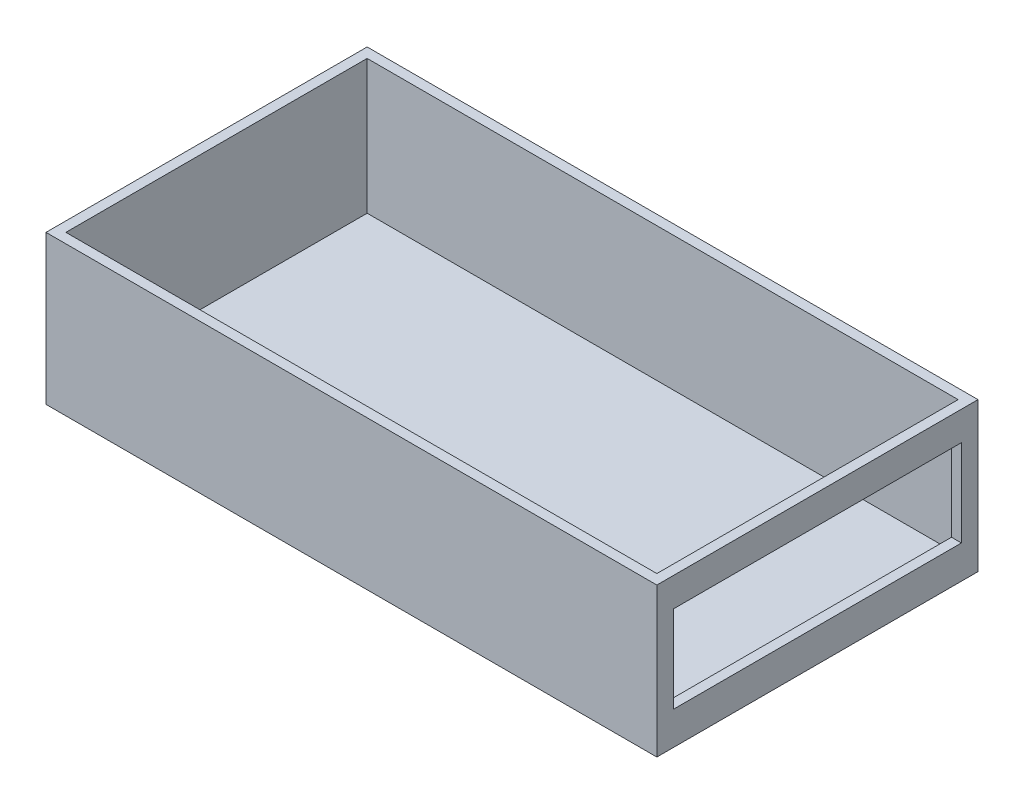
ISO-10303-21;
HEADER;
FILE_DESCRIPTION(('STEP AP214'),'2;1');
FILE_NAME('part.step','',(''),(''),'','','');
FILE_SCHEMA(('AUTOMOTIVE_DESIGN { 1 0 10303 214 1 1 1 1 }'));
ENDSEC;
DATA;
#1=APPLICATION_CONTEXT('core data for automotive mechanical design processes');
#2=APPLICATION_PROTOCOL_DEFINITION('international standard','automotive_design',2000,#1);
#3=PRODUCT_CONTEXT('',#1,'mechanical');
#4=PRODUCT('Part','Part','',(#3));
#5=PRODUCT_RELATED_PRODUCT_CATEGORY('part','',(#4));
#6=PRODUCT_DEFINITION_FORMATION('','',#4);
#7=PRODUCT_DEFINITION_CONTEXT('part definition',#1,'design');
#8=PRODUCT_DEFINITION('design','',#6,#7);
#9=PRODUCT_DEFINITION_SHAPE('','',#8);
#10=(LENGTH_UNIT() NAMED_UNIT(*) SI_UNIT(.MILLI.,.METRE.));
#11=(NAMED_UNIT(*) PLANE_ANGLE_UNIT() SI_UNIT($,.RADIAN.));
#12=(NAMED_UNIT(*) SI_UNIT($,.STERADIAN.) SOLID_ANGLE_UNIT());
#13=UNCERTAINTY_MEASURE_WITH_UNIT(LENGTH_MEASURE(1.E-05),#10,'distance_accuracy_value','');
#14=(GEOMETRIC_REPRESENTATION_CONTEXT(3) GLOBAL_UNCERTAINTY_ASSIGNED_CONTEXT((#13)) GLOBAL_UNIT_ASSIGNED_CONTEXT((#10,
#11,#12)) REPRESENTATION_CONTEXT('',''));
#15=CARTESIAN_POINT('',(0.,0.,0.));
#16=DIRECTION('',(0.,0.,1.));
#17=DIRECTION('',(1.,0.,0.));
#18=AXIS2_PLACEMENT_3D('',#15,#16,#17);
#19=CARTESIAN_POINT('',(-36.9,1.8,0.));
#20=DIRECTION('',(-1.,0.,0.));
#21=DIRECTION('',(0.,0.,1.));
#22=AXIS2_PLACEMENT_3D('',#19,#20,#21);
#23=PLANE('',#22);
#24=DIRECTION('',(0.,0.,-1.));
#25=VECTOR('',#24,1.);
#26=CARTESIAN_POINT('',(-36.9,0.,0.));
#27=LINE('',#26,#25);
#28=CARTESIAN_POINT('',(-36.9,0.,19.4));
#29=VERTEX_POINT('',#28);
#30=CARTESIAN_POINT('',(-36.9,0.,-19.4));
#31=VERTEX_POINT('',#30);
#32=EDGE_CURVE('E202',#29,#31,#27,.T.);
#33=ORIENTED_EDGE('',*,*,#32,.F.);
#34=DIRECTION('',(0.,-1.,0.));
#35=VECTOR('',#34,1.);
#36=CARTESIAN_POINT('',(-36.9,1.8,19.4));
#37=LINE('',#36,#35);
#38=CARTESIAN_POINT('',(-36.9,18.,19.4));
#39=VERTEX_POINT('',#38);
#40=EDGE_CURVE('E11',#39,#29,#37,.T.);
#41=ORIENTED_EDGE('',*,*,#40,.F.);
#42=DIRECTION('',(0.,0.,1.));
#43=VECTOR('',#42,1.);
#44=CARTESIAN_POINT('',(-36.9,18.,19.4));
#45=LINE('',#44,#43);
#46=CARTESIAN_POINT('',(-36.9,18.,-19.4));
#47=VERTEX_POINT('',#46);
#48=EDGE_CURVE('E178',#47,#39,#45,.T.);
#49=ORIENTED_EDGE('',*,*,#48,.F.);
#50=DIRECTION('',(0.,-1.,0.));
#51=VECTOR('',#50,1.);
#52=CARTESIAN_POINT('',(-36.9,1.8,-19.4));
#53=LINE('',#52,#51);
#54=EDGE_CURVE('E213',#47,#31,#53,.T.);
#55=ORIENTED_EDGE('',*,*,#54,.T.);
#56=EDGE_LOOP('',(#33,#41,#49,#55));
#57=FACE_BOUND('',#56,.T.);
#58=ADVANCED_FACE('F33',(#57),#23,.T.);
#59=CARTESIAN_POINT('',(0.,1.8,19.4));
#60=DIRECTION('',(0.,0.,1.));
#61=DIRECTION('',(1.,0.,0.));
#62=AXIS2_PLACEMENT_3D('',#59,#60,#61);
#63=PLANE('',#62);
#64=DIRECTION('',(-1.,0.,0.));
#65=VECTOR('',#64,1.);
#66=CARTESIAN_POINT('',(0.,0.,19.4));
#67=LINE('',#66,#65);
#68=CARTESIAN_POINT('',(36.9,0.,19.4));
#69=VERTEX_POINT('',#68);
#70=EDGE_CURVE('E205',#69,#29,#67,.T.);
#71=ORIENTED_EDGE('',*,*,#70,.F.);
#72=DIRECTION('',(0.,-1.,0.));
#73=VECTOR('',#72,1.);
#74=CARTESIAN_POINT('',(36.9,1.8,19.4));
#75=LINE('',#74,#73);
#76=CARTESIAN_POINT('',(36.9,18.,19.4));
#77=VERTEX_POINT('',#76);
#78=EDGE_CURVE('E40',#77,#69,#75,.T.);
#79=ORIENTED_EDGE('',*,*,#78,.F.);
#80=DIRECTION('',(1.,0.,0.));
#81=VECTOR('',#80,1.);
#82=CARTESIAN_POINT('',(36.9,18.,19.4));
#83=LINE('',#82,#81);
#84=EDGE_CURVE('E181',#39,#77,#83,.T.);
#85=ORIENTED_EDGE('',*,*,#84,.F.);
#86=ORIENTED_EDGE('',*,*,#40,.T.);
#87=EDGE_LOOP('',(#71,#79,#85,#86));
#88=FACE_BOUND('',#87,.T.);
#89=ADVANCED_FACE('F227',(#88),#63,.T.);
#90=CARTESIAN_POINT('',(36.9,1.8,0.));
#91=DIRECTION('',(-1.,0.,0.));
#92=DIRECTION('',(0.,0.,1.));
#93=AXIS2_PLACEMENT_3D('',#90,#91,#92);
#94=PLANE('',#93);
#95=DIRECTION('',(0.,1.,0.));
#96=VECTOR('',#95,1.);
#97=CARTESIAN_POINT('',(36.9,4.,-17.4));
#98=LINE('',#97,#96);
#99=CARTESIAN_POINT('',(36.9,4.,-17.4));
#100=VERTEX_POINT('',#99);
#101=CARTESIAN_POINT('',(36.9,14.5,-17.4));
#102=VERTEX_POINT('',#101);
#103=EDGE_CURVE('E144',#100,#102,#98,.T.);
#104=ORIENTED_EDGE('',*,*,#103,.F.);
#105=DIRECTION('',(0.,0.,-1.));
#106=VECTOR('',#105,1.);
#107=CARTESIAN_POINT('',(36.9,4.,-17.4));
#108=LINE('',#107,#106);
#109=CARTESIAN_POINT('',(36.9,4.,17.4));
#110=VERTEX_POINT('',#109);
#111=EDGE_CURVE('E137',#110,#100,#108,.T.);
#112=ORIENTED_EDGE('',*,*,#111,.F.);
#113=DIRECTION('',(0.,-1.,0.));
#114=VECTOR('',#113,1.);
#115=CARTESIAN_POINT('',(36.9,4.,17.4));
#116=LINE('',#115,#114);
#117=CARTESIAN_POINT('',(36.9,14.5,17.4));
#118=VERTEX_POINT('',#117);
#119=EDGE_CURVE('E148',#118,#110,#116,.T.);
#120=ORIENTED_EDGE('',*,*,#119,.F.);
#121=DIRECTION('',(0.,0.,1.));
#122=VECTOR('',#121,1.);
#123=CARTESIAN_POINT('',(36.9,14.5,-17.4));
#124=LINE('',#123,#122);
#125=EDGE_CURVE('E47',#102,#118,#124,.T.);
#126=ORIENTED_EDGE('',*,*,#125,.F.);
#127=EDGE_LOOP('',(#104,#112,#120,#126));
#128=FACE_BOUND('',#127,.T.);
#129=DIRECTION('',(0.,0.,-1.));
#130=VECTOR('',#129,1.);
#131=CARTESIAN_POINT('',(36.9,0.,0.));
#132=LINE('',#131,#130);
#133=CARTESIAN_POINT('',(36.9,0.,-19.4));
#134=VERTEX_POINT('',#133);
#135=EDGE_CURVE('E208',#69,#134,#132,.T.);
#136=ORIENTED_EDGE('',*,*,#135,.T.);
#137=DIRECTION('',(0.,-1.,0.));
#138=VECTOR('',#137,1.);
#139=CARTESIAN_POINT('',(36.9,1.8,-19.4));
#140=LINE('',#139,#138);
#141=CARTESIAN_POINT('',(36.9,18.,-19.4));
#142=VERTEX_POINT('',#141);
#143=EDGE_CURVE('E215',#142,#134,#140,.T.);
#144=ORIENTED_EDGE('',*,*,#143,.F.);
#145=DIRECTION('',(0.,0.,-1.));
#146=VECTOR('',#145,1.);
#147=CARTESIAN_POINT('',(36.9,18.,19.4));
#148=LINE('',#147,#146);
#149=EDGE_CURVE('E184',#77,#142,#148,.T.);
#150=ORIENTED_EDGE('',*,*,#149,.F.);
#151=ORIENTED_EDGE('',*,*,#78,.T.);
#152=EDGE_LOOP('',(#136,#144,#150,#151));
#153=FACE_BOUND('',#152,.T.);
#154=ADVANCED_FACE('F220',(#128,#153),#94,.F.);
#155=CARTESIAN_POINT('',(0.,1.8,-19.4));
#156=DIRECTION('',(0.,0.,1.));
#157=DIRECTION('',(1.,0.,0.));
#158=AXIS2_PLACEMENT_3D('',#155,#156,#157);
#159=PLANE('',#158);
#160=DIRECTION('',(-1.,0.,0.));
#161=VECTOR('',#160,1.);
#162=CARTESIAN_POINT('',(0.,0.,-19.4));
#163=LINE('',#162,#161);
#164=EDGE_CURVE('E210',#134,#31,#163,.T.);
#165=ORIENTED_EDGE('',*,*,#164,.T.);
#166=ORIENTED_EDGE('',*,*,#54,.F.);
#167=DIRECTION('',(-1.,0.,0.));
#168=VECTOR('',#167,1.);
#169=CARTESIAN_POINT('',(36.9,18.,-19.4));
#170=LINE('',#169,#168);
#171=EDGE_CURVE('E187',#142,#47,#170,.T.);
#172=ORIENTED_EDGE('',*,*,#171,.F.);
#173=ORIENTED_EDGE('',*,*,#143,.T.);
#174=EDGE_LOOP('',(#165,#166,#172,#173));
#175=FACE_BOUND('',#174,.T.);
#176=ADVANCED_FACE('F233',(#175),#159,.F.);
#177=CARTESIAN_POINT('',(0.,0.,0.));
#178=DIRECTION('',(0.,1.,0.));
#179=DIRECTION('',(0.,0.,1.));
#180=AXIS2_PLACEMENT_3D('',#177,#178,#179);
#181=PLANE('',#180);
#182=ORIENTED_EDGE('',*,*,#32,.T.);
#183=ORIENTED_EDGE('',*,*,#164,.F.);
#184=ORIENTED_EDGE('',*,*,#135,.F.);
#185=ORIENTED_EDGE('',*,*,#70,.T.);
#186=EDGE_LOOP('',(#182,#183,#184,#185));
#187=FACE_BOUND('',#186,.T.);
#188=ADVANCED_FACE('F226',(#187),#181,.F.);
#189=CARTESIAN_POINT('',(0.,18.,0.));
#190=DIRECTION('',(0.,1.,0.));
#191=DIRECTION('',(0.,0.,1.));
#192=AXIS2_PLACEMENT_3D('',#189,#190,#191);
#193=PLANE('',#192);
#194=ORIENTED_EDGE('',*,*,#48,.T.);
#195=ORIENTED_EDGE('',*,*,#84,.T.);
#196=ORIENTED_EDGE('',*,*,#149,.T.);
#197=ORIENTED_EDGE('',*,*,#171,.T.);
#198=EDGE_LOOP('',(#194,#195,#196,#197));
#199=FACE_BOUND('',#198,.T.);
#200=DIRECTION('',(1.,0.,0.));
#201=VECTOR('',#200,1.);
#202=CARTESIAN_POINT('',(35.7,18.,18.2));
#203=LINE('',#202,#201);
#204=CARTESIAN_POINT('',(-35.7,18.,18.2));
#205=VERTEX_POINT('',#204);
#206=CARTESIAN_POINT('',(35.7,18.,18.2));
#207=VERTEX_POINT('',#206);
#208=EDGE_CURVE('E159',#205,#207,#203,.T.);
#209=ORIENTED_EDGE('',*,*,#208,.F.);
#210=DIRECTION('',(0.,0.,1.));
#211=VECTOR('',#210,1.);
#212=CARTESIAN_POINT('',(-35.7,18.,18.2));
#213=LINE('',#212,#211);
#214=CARTESIAN_POINT('',(-35.7,18.,-18.2));
#215=VERTEX_POINT('',#214);
#216=EDGE_CURVE('E157',#215,#205,#213,.T.);
#217=ORIENTED_EDGE('',*,*,#216,.F.);
#218=DIRECTION('',(-1.,0.,0.));
#219=VECTOR('',#218,1.);
#220=CARTESIAN_POINT('',(35.7,18.,-18.2));
#221=LINE('',#220,#219);
#222=CARTESIAN_POINT('',(35.7,18.,-18.2));
#223=VERTEX_POINT('',#222);
#224=EDGE_CURVE('E164',#223,#215,#221,.T.);
#225=ORIENTED_EDGE('',*,*,#224,.F.);
#226=DIRECTION('',(0.,0.,-1.));
#227=VECTOR('',#226,1.);
#228=CARTESIAN_POINT('',(35.7,18.,18.2));
#229=LINE('',#228,#227);
#230=EDGE_CURVE('E161',#207,#223,#229,.T.);
#231=ORIENTED_EDGE('',*,*,#230,.F.);
#232=EDGE_LOOP('',(#209,#217,#225,#231));
#233=FACE_BOUND('',#232,.T.);
#234=ADVANCED_FACE('F235',(#199,#233),#193,.T.);
#235=CARTESIAN_POINT('',(-35.7,18.,18.2));
#236=DIRECTION('',(1.,0.,0.));
#237=DIRECTION('',(0.,0.,-1.));
#238=AXIS2_PLACEMENT_3D('',#235,#236,#237);
#239=PLANE('',#238);
#240=DIRECTION('',(0.,-1.,0.));
#241=VECTOR('',#240,1.);
#242=CARTESIAN_POINT('',(-35.7,18.,18.2));
#243=LINE('',#242,#241);
#244=CARTESIAN_POINT('',(-35.7,1.8,18.2));
#245=VERTEX_POINT('',#244);
#246=EDGE_CURVE('E175',#205,#245,#243,.T.);
#247=ORIENTED_EDGE('',*,*,#246,.T.);
#248=DIRECTION('',(0.,0.,-1.));
#249=VECTOR('',#248,1.);
#250=CARTESIAN_POINT('',(-35.7,1.8,0.));
#251=LINE('',#250,#249);
#252=CARTESIAN_POINT('',(-35.7,1.8,-18.2));
#253=VERTEX_POINT('',#252);
#254=EDGE_CURVE('E199',#245,#253,#251,.T.);
#255=ORIENTED_EDGE('',*,*,#254,.T.);
#256=DIRECTION('',(0.,-1.,0.));
#257=VECTOR('',#256,1.);
#258=CARTESIAN_POINT('',(-35.7,18.,-18.2));
#259=LINE('',#258,#257);
#260=EDGE_CURVE('E166',#215,#253,#259,.T.);
#261=ORIENTED_EDGE('',*,*,#260,.F.);
#262=ORIENTED_EDGE('',*,*,#216,.T.);
#263=EDGE_LOOP('',(#247,#255,#261,#262));
#264=FACE_BOUND('',#263,.T.);
#265=ADVANCED_FACE('F238',(#264),#239,.T.);
#266=CARTESIAN_POINT('',(35.7,18.,18.2));
#267=DIRECTION('',(0.,0.,-1.));
#268=DIRECTION('',(-1.,0.,0.));
#269=AXIS2_PLACEMENT_3D('',#266,#267,#268);
#270=PLANE('',#269);
#271=DIRECTION('',(0.,-1.,0.));
#272=VECTOR('',#271,1.);
#273=CARTESIAN_POINT('',(35.7,18.,18.2));
#274=LINE('',#273,#272);
#275=CARTESIAN_POINT('',(35.7,1.8,18.2));
#276=VERTEX_POINT('',#275);
#277=EDGE_CURVE('E172',#207,#276,#274,.T.);
#278=ORIENTED_EDGE('',*,*,#277,.T.);
#279=DIRECTION('',(-1.,0.,0.));
#280=VECTOR('',#279,1.);
#281=CARTESIAN_POINT('',(0.,1.8,18.2));
#282=LINE('',#281,#280);
#283=EDGE_CURVE('E196',#276,#245,#282,.T.);
#284=ORIENTED_EDGE('',*,*,#283,.T.);
#285=ORIENTED_EDGE('',*,*,#246,.F.);
#286=ORIENTED_EDGE('',*,*,#208,.T.);
#287=EDGE_LOOP('',(#278,#284,#285,#286));
#288=FACE_BOUND('',#287,.T.);
#289=ADVANCED_FACE('F247',(#288),#270,.T.);
#290=CARTESIAN_POINT('',(35.7,18.,18.2));
#291=DIRECTION('',(-1.,0.,0.));
#292=DIRECTION('',(0.,0.,1.));
#293=AXIS2_PLACEMENT_3D('',#290,#291,#292);
#294=PLANE('',#293);
#295=DIRECTION('',(0.,0.,-1.));
#296=VECTOR('',#295,1.);
#297=CARTESIAN_POINT('',(35.7,4.,-17.4));
#298=LINE('',#297,#296);
#299=CARTESIAN_POINT('',(35.7,4.,17.4));
#300=VERTEX_POINT('',#299);
#301=CARTESIAN_POINT('',(35.7,4.,-17.4));
#302=VERTEX_POINT('',#301);
#303=EDGE_CURVE('E134',#300,#302,#298,.T.);
#304=ORIENTED_EDGE('',*,*,#303,.T.);
#305=DIRECTION('',(0.,1.,0.));
#306=VECTOR('',#305,1.);
#307=CARTESIAN_POINT('',(35.7,4.,-17.4));
#308=LINE('',#307,#306);
#309=CARTESIAN_POINT('',(35.7,14.5,-17.4));
#310=VERTEX_POINT('',#309);
#311=EDGE_CURVE('E121',#302,#310,#308,.T.);
#312=ORIENTED_EDGE('',*,*,#311,.T.);
#313=DIRECTION('',(0.,0.,1.));
#314=VECTOR('',#313,1.);
#315=CARTESIAN_POINT('',(35.7,14.5,-17.4));
#316=LINE('',#315,#314);
#317=CARTESIAN_POINT('',(35.7,14.5,17.4));
#318=VERTEX_POINT('',#317);
#319=EDGE_CURVE('E152',#310,#318,#316,.T.);
#320=ORIENTED_EDGE('',*,*,#319,.T.);
#321=DIRECTION('',(0.,-1.,0.));
#322=VECTOR('',#321,1.);
#323=CARTESIAN_POINT('',(35.7,4.,17.4));
#324=LINE('',#323,#322);
#325=EDGE_CURVE('E142',#318,#300,#324,.T.);
#326=ORIENTED_EDGE('',*,*,#325,.T.);
#327=EDGE_LOOP('',(#304,#312,#320,#326));
#328=FACE_BOUND('',#327,.T.);
#329=DIRECTION('',(0.,-1.,0.));
#330=VECTOR('',#329,1.);
#331=CARTESIAN_POINT('',(35.7,18.,-18.2));
#332=LINE('',#331,#330);
#333=CARTESIAN_POINT('',(35.7,1.8,-18.2));
#334=VERTEX_POINT('',#333);
#335=EDGE_CURVE('E169',#223,#334,#332,.T.);
#336=ORIENTED_EDGE('',*,*,#335,.T.);
#337=DIRECTION('',(0.,0.,1.));
#338=VECTOR('',#337,1.);
#339=CARTESIAN_POINT('',(35.7,1.8,0.));
#340=LINE('',#339,#338);
#341=EDGE_CURVE('E193',#334,#276,#340,.T.);
#342=ORIENTED_EDGE('',*,*,#341,.T.);
#343=ORIENTED_EDGE('',*,*,#277,.F.);
#344=ORIENTED_EDGE('',*,*,#230,.T.);
#345=EDGE_LOOP('',(#336,#342,#343,#344));
#346=FACE_BOUND('',#345,.T.);
#347=ADVANCED_FACE('F140',(#328,#346),#294,.T.);
#348=CARTESIAN_POINT('',(35.7,18.,-18.2));
#349=DIRECTION('',(0.,0.,1.));
#350=DIRECTION('',(1.,0.,0.));
#351=AXIS2_PLACEMENT_3D('',#348,#349,#350);
#352=PLANE('',#351);
#353=ORIENTED_EDGE('',*,*,#260,.T.);
#354=DIRECTION('',(1.,0.,0.));
#355=VECTOR('',#354,1.);
#356=CARTESIAN_POINT('',(0.,1.8,-18.2));
#357=LINE('',#356,#355);
#358=EDGE_CURVE('E190',#253,#334,#357,.T.);
#359=ORIENTED_EDGE('',*,*,#358,.T.);
#360=ORIENTED_EDGE('',*,*,#335,.F.);
#361=ORIENTED_EDGE('',*,*,#224,.T.);
#362=EDGE_LOOP('',(#353,#359,#360,#361));
#363=FACE_BOUND('',#362,.T.);
#364=ADVANCED_FACE('F251',(#363),#352,.T.);
#365=CARTESIAN_POINT('',(0.,1.8,0.));
#366=DIRECTION('',(0.,1.,0.));
#367=DIRECTION('',(0.,0.,1.));
#368=AXIS2_PLACEMENT_3D('',#365,#366,#367);
#369=PLANE('',#368);
#370=ORIENTED_EDGE('',*,*,#254,.F.);
#371=ORIENTED_EDGE('',*,*,#283,.F.);
#372=ORIENTED_EDGE('',*,*,#341,.F.);
#373=ORIENTED_EDGE('',*,*,#358,.F.);
#374=EDGE_LOOP('',(#370,#371,#372,#373));
#375=FACE_BOUND('',#374,.T.);
#376=ADVANCED_FACE('F249',(#375),#369,.T.);
#377=CARTESIAN_POINT('',(-0.649552954610041,4.,-17.4));
#378=DIRECTION('',(0.,-1.,0.));
#379=DIRECTION('',(0.,0.,-1.));
#380=AXIS2_PLACEMENT_3D('',#377,#378,#379);
#381=PLANE('',#380);
#382=DIRECTION('',(1.,0.,0.));
#383=VECTOR('',#382,1.);
#384=CARTESIAN_POINT('',(-0.649552954610041,4.,17.4));
#385=LINE('',#384,#383);
#386=EDGE_CURVE('E55',#300,#110,#385,.T.);
#387=ORIENTED_EDGE('',*,*,#386,.T.);
#388=ORIENTED_EDGE('',*,*,#111,.T.);
#389=DIRECTION('',(1.,0.,0.));
#390=VECTOR('',#389,1.);
#391=CARTESIAN_POINT('',(-0.649552954610041,4.,-17.4));
#392=LINE('',#391,#390);
#393=EDGE_CURVE('E125',#302,#100,#392,.T.);
#394=ORIENTED_EDGE('',*,*,#393,.F.);
#395=ORIENTED_EDGE('',*,*,#303,.F.);
#396=EDGE_LOOP('',(#387,#388,#394,#395));
#397=FACE_BOUND('',#396,.T.);
#398=ADVANCED_FACE('F133',(#397),#381,.F.);
#399=CARTESIAN_POINT('',(-0.649552954610041,4.,-17.4));
#400=DIRECTION('',(0.,0.,-1.));
#401=DIRECTION('',(0.,1.,0.));
#402=AXIS2_PLACEMENT_3D('',#399,#400,#401);
#403=PLANE('',#402);
#404=ORIENTED_EDGE('',*,*,#393,.T.);
#405=ORIENTED_EDGE('',*,*,#103,.T.);
#406=DIRECTION('',(1.,0.,0.));
#407=VECTOR('',#406,1.);
#408=CARTESIAN_POINT('',(-0.649552954610041,14.5,-17.4));
#409=LINE('',#408,#407);
#410=EDGE_CURVE('E127',#310,#102,#409,.T.);
#411=ORIENTED_EDGE('',*,*,#410,.F.);
#412=ORIENTED_EDGE('',*,*,#311,.F.);
#413=EDGE_LOOP('',(#404,#405,#411,#412));
#414=FACE_BOUND('',#413,.T.);
#415=ADVANCED_FACE('F123',(#414),#403,.F.);
#416=CARTESIAN_POINT('',(-0.649552954610041,14.5,-17.4));
#417=DIRECTION('',(0.,1.,0.));
#418=DIRECTION('',(0.,0.,1.));
#419=AXIS2_PLACEMENT_3D('',#416,#417,#418);
#420=PLANE('',#419);
#421=ORIENTED_EDGE('',*,*,#410,.T.);
#422=ORIENTED_EDGE('',*,*,#125,.T.);
#423=DIRECTION('',(1.,0.,0.));
#424=VECTOR('',#423,1.);
#425=CARTESIAN_POINT('',(-0.649552954610041,14.5,17.4));
#426=LINE('',#425,#424);
#427=EDGE_CURVE('E151',#318,#118,#426,.T.);
#428=ORIENTED_EDGE('',*,*,#427,.F.);
#429=ORIENTED_EDGE('',*,*,#319,.F.);
#430=EDGE_LOOP('',(#421,#422,#428,#429));
#431=FACE_BOUND('',#430,.T.);
#432=ADVANCED_FACE('F288',(#431),#420,.F.);
#433=CARTESIAN_POINT('',(-0.649552954610041,4.,17.4));
#434=DIRECTION('',(0.,0.,1.));
#435=DIRECTION('',(1.,0.,0.));
#436=AXIS2_PLACEMENT_3D('',#433,#434,#435);
#437=PLANE('',#436);
#438=ORIENTED_EDGE('',*,*,#427,.T.);
#439=ORIENTED_EDGE('',*,*,#119,.T.);
#440=ORIENTED_EDGE('',*,*,#386,.F.);
#441=ORIENTED_EDGE('',*,*,#325,.F.);
#442=EDGE_LOOP('',(#438,#439,#440,#441));
#443=FACE_BOUND('',#442,.T.);
#444=ADVANCED_FACE('F291',(#443),#437,.F.);
#445=CLOSED_SHELL('',(#58,#89,#154,#176,#188,#234,#265,#289,#347,#364,#376,#398,#415,#432,#444));
#446=MANIFOLD_SOLID_BREP('B2',#445);
#447=ADVANCED_BREP_SHAPE_REPRESENTATION('',(#18,#446),#14);
#448=SHAPE_DEFINITION_REPRESENTATION(#9,#447);
ENDSEC;
END-ISO-10303-21;
